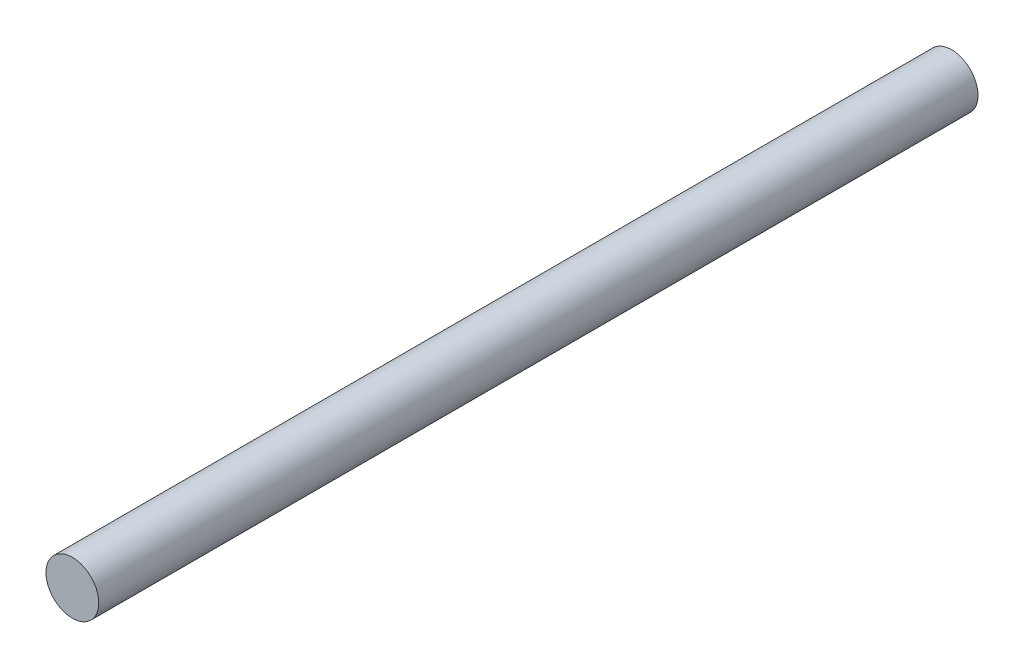
ISO-10303-21;
HEADER;
FILE_DESCRIPTION(('STEP AP214'),'2;1');
FILE_NAME('part.step','',(''),(''),'','','');
FILE_SCHEMA(('AUTOMOTIVE_DESIGN { 1 0 10303 214 1 1 1 1 }'));
ENDSEC;
DATA;
#1=APPLICATION_CONTEXT('core data for automotive mechanical design processes');
#2=APPLICATION_PROTOCOL_DEFINITION('international standard','automotive_design',2000,#1);
#3=PRODUCT_CONTEXT('',#1,'mechanical');
#4=PRODUCT('Part','Part','',(#3));
#5=PRODUCT_RELATED_PRODUCT_CATEGORY('part','',(#4));
#6=PRODUCT_DEFINITION_FORMATION('','',#4);
#7=PRODUCT_DEFINITION_CONTEXT('part definition',#1,'design');
#8=PRODUCT_DEFINITION('design','',#6,#7);
#9=PRODUCT_DEFINITION_SHAPE('','',#8);
#10=(LENGTH_UNIT() NAMED_UNIT(*) SI_UNIT(.MILLI.,.METRE.));
#11=(NAMED_UNIT(*) PLANE_ANGLE_UNIT() SI_UNIT($,.RADIAN.));
#12=(NAMED_UNIT(*) SI_UNIT($,.STERADIAN.) SOLID_ANGLE_UNIT());
#13=UNCERTAINTY_MEASURE_WITH_UNIT(LENGTH_MEASURE(1.E-05),#10,'distance_accuracy_value','');
#14=(GEOMETRIC_REPRESENTATION_CONTEXT(3) GLOBAL_UNCERTAINTY_ASSIGNED_CONTEXT((#13)) GLOBAL_UNIT_ASSIGNED_CONTEXT((#10,
#11,#12)) REPRESENTATION_CONTEXT('',''));
#15=CARTESIAN_POINT('',(0.,0.,0.));
#16=DIRECTION('',(0.,0.,1.));
#17=DIRECTION('',(1.,0.,0.));
#18=AXIS2_PLACEMENT_3D('',#15,#16,#17);
#19=CARTESIAN_POINT('',(0.,0.,328.4));
#20=DIRECTION('',(0.,0.,1.));
#21=DIRECTION('',(1.,0.,0.));
#22=AXIS2_PLACEMENT_3D('',#19,#20,#21);
#23=PLANE('',#22);
#24=CARTESIAN_POINT('',(-2.32074115854082E-12,0.,328.4));
#25=DIRECTION('',(0.,0.,1.));
#26=DIRECTION('',(1.,0.,0.));
#27=AXIS2_PLACEMENT_3D('',#24,#25,#26);
#28=CIRCLE('',#27,3.933);
#29=CARTESIAN_POINT('',(3.93299999999768,0.,328.4));
#30=VERTEX_POINT('',#29);
#31=EDGE_CURVE('E18',#30,#30,#28,.F.);
#32=ORIENTED_EDGE('',*,*,#31,.F.);
#33=EDGE_LOOP('',(#32));
#34=FACE_BOUND('',#33,.T.);
#35=ADVANCED_FACE('F15',(#34),#23,.T.);
#36=CARTESIAN_POINT('',(4.00000000000001,0.,197.444));
#37=DIRECTION('',(0.,0.,-1.));
#38=DIRECTION('',(-1.,0.,0.));
#39=AXIS2_PLACEMENT_3D('',#36,#37,#38);
#40=PLANE('',#39);
#41=CARTESIAN_POINT('',(2.33175056666921E-12,0.,197.444));
#42=DIRECTION('',(0.,0.,1.));
#43=DIRECTION('',(1.,0.,0.));
#44=AXIS2_PLACEMENT_3D('',#41,#42,#43);
#45=CIRCLE('',#44,3.933);
#46=CARTESIAN_POINT('',(3.93300000000233,0.,197.444));
#47=VERTEX_POINT('',#46);
#48=EDGE_CURVE('E10',#47,#47,#45,.T.);
#49=ORIENTED_EDGE('',*,*,#48,.F.);
#50=EDGE_LOOP('',(#49));
#51=FACE_BOUND('',#50,.T.);
#52=ADVANCED_FACE('F30',(#51),#40,.T.);
#53=CARTESIAN_POINT('',(0.,0.,262.922));
#54=DIRECTION('',(0.,0.,1.));
#55=DIRECTION('',(1.,0.,0.));
#56=AXIS2_PLACEMENT_3D('',#53,#54,#55);
#57=CYLINDRICAL_SURFACE('',#56,3.933);
#58=ORIENTED_EDGE('',*,*,#48,.T.);
#59=EDGE_LOOP('',(#58));
#60=FACE_BOUND('',#59,.T.);
#61=ORIENTED_EDGE('',*,*,#31,.T.);
#62=EDGE_LOOP('',(#61));
#63=FACE_BOUND('',#62,.T.);
#64=ADVANCED_FACE('F27',(#60,#63),#57,.T.);
#65=CLOSED_SHELL('',(#35,#52,#64));
#66=MANIFOLD_SOLID_BREP('B1',#65);
#67=ADVANCED_BREP_SHAPE_REPRESENTATION('',(#18,#66),#14);
#68=SHAPE_DEFINITION_REPRESENTATION(#9,#67);
ENDSEC;
END-ISO-10303-21;
